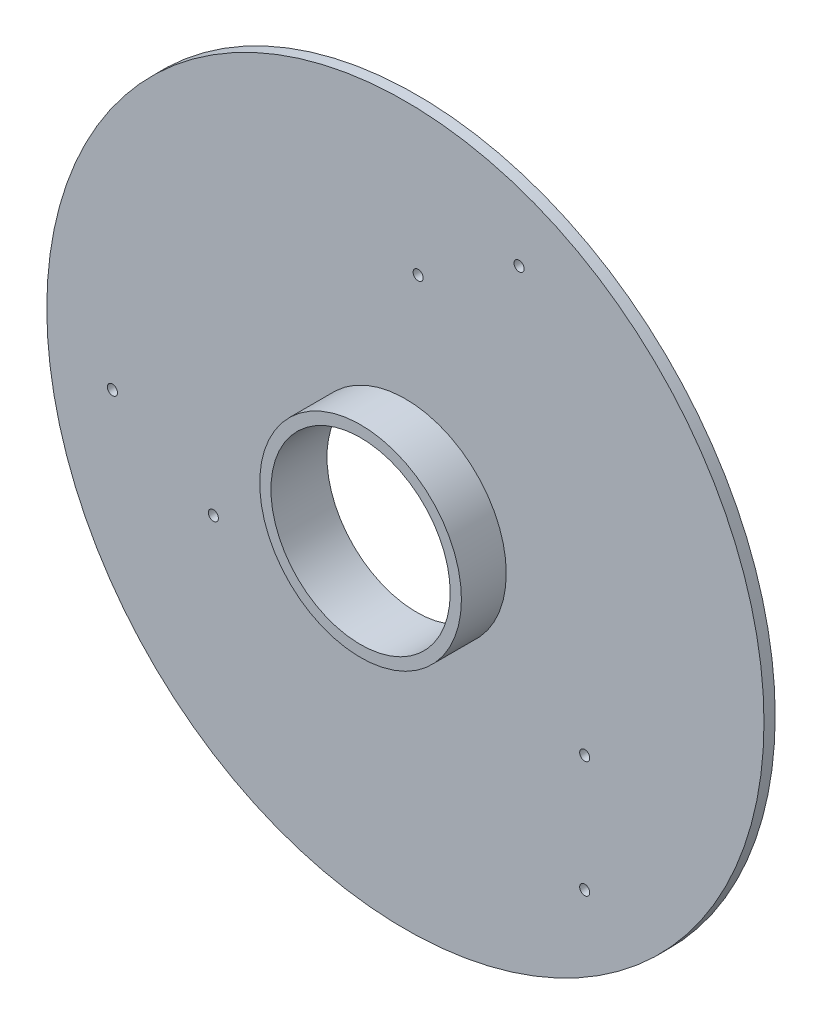
ISO-10303-21;
HEADER;
FILE_DESCRIPTION(('STEP AP214'),'2;1');
FILE_NAME('part.step','',(''),(''),'','','');
FILE_SCHEMA(('AUTOMOTIVE_DESIGN { 1 0 10303 214 1 1 1 1 }'));
ENDSEC;
DATA;
#1=APPLICATION_CONTEXT('core data for automotive mechanical design processes');
#2=APPLICATION_PROTOCOL_DEFINITION('international standard','automotive_design',2000,#1);
#3=PRODUCT_CONTEXT('',#1,'mechanical');
#4=PRODUCT('Part','Part','',(#3));
#5=PRODUCT_RELATED_PRODUCT_CATEGORY('part','',(#4));
#6=PRODUCT_DEFINITION_FORMATION('','',#4);
#7=PRODUCT_DEFINITION_CONTEXT('part definition',#1,'design');
#8=PRODUCT_DEFINITION('design','',#6,#7);
#9=PRODUCT_DEFINITION_SHAPE('','',#8);
#10=(LENGTH_UNIT() NAMED_UNIT(*) SI_UNIT(.MILLI.,.METRE.));
#11=(NAMED_UNIT(*) PLANE_ANGLE_UNIT() SI_UNIT($,.RADIAN.));
#12=(NAMED_UNIT(*) SI_UNIT($,.STERADIAN.) SOLID_ANGLE_UNIT());
#13=UNCERTAINTY_MEASURE_WITH_UNIT(LENGTH_MEASURE(1.E-05),#10,'distance_accuracy_value','');
#14=(GEOMETRIC_REPRESENTATION_CONTEXT(3) GLOBAL_UNCERTAINTY_ASSIGNED_CONTEXT((#13)) GLOBAL_UNIT_ASSIGNED_CONTEXT((#10,
#11,#12)) REPRESENTATION_CONTEXT('',''));
#15=CARTESIAN_POINT('',(0.,0.,0.));
#16=DIRECTION('',(0.,0.,1.));
#17=DIRECTION('',(1.,0.,0.));
#18=AXIS2_PLACEMENT_3D('',#15,#16,#17);
#19=CARTESIAN_POINT('',(0.,0.,50.));
#20=DIRECTION('',(0.,0.,1.));
#21=DIRECTION('',(1.,0.,0.));
#22=AXIS2_PLACEMENT_3D('',#19,#20,#21);
#23=PLANE('',#22);
#24=CARTESIAN_POINT('',(0.,0.,50.));
#25=DIRECTION('',(0.,0.,1.));
#26=DIRECTION('',(1.,0.,0.));
#27=AXIS2_PLACEMENT_3D('',#24,#25,#26);
#28=CIRCLE('',#27,450.);
#29=CARTESIAN_POINT('',(450.,0.,50.));
#30=VERTEX_POINT('',#29);
#31=EDGE_CURVE('E86',#30,#30,#28,.T.);
#32=ORIENTED_EDGE('',*,*,#31,.F.);
#33=EDGE_LOOP('',(#32));
#34=FACE_BOUND('',#33,.T.);
#35=CARTESIAN_POINT('',(507.16161046421,1216.57032302755,50.));
#36=DIRECTION('',(0.,0.,1.));
#37=DIRECTION('',(1.,0.,0.));
#38=AXIS2_PLACEMENT_3D('',#35,#36,#37);
#39=CIRCLE('',#38,22.5);
#40=CARTESIAN_POINT('',(529.66161046421,1216.57032302755,50.));
#41=VERTEX_POINT('',#40);
#42=EDGE_CURVE('E68',#41,#41,#39,.T.);
#43=ORIENTED_EDGE('',*,*,#42,.F.);
#44=EDGE_LOOP('',(#43));
#45=FACE_BOUND('',#44,.T.);
#46=CARTESIAN_POINT('',(-1307.1616104642,-169.070323027545,50.));
#47=DIRECTION('',(0.,0.,1.));
#48=DIRECTION('',(1.,0.,0.));
#49=AXIS2_PLACEMENT_3D('',#46,#47,#48);
#50=CIRCLE('',#49,22.4999999999999);
#51=CARTESIAN_POINT('',(-1284.6616104642,-169.070323027545,50.));
#52=VERTEX_POINT('',#51);
#53=EDGE_CURVE('E56',#52,#52,#50,.T.);
#54=ORIENTED_EDGE('',*,*,#53,.F.);
#55=EDGE_LOOP('',(#54));
#56=FACE_BOUND('',#55,.T.);
#57=CARTESIAN_POINT('',(800.,-1047.5,50.));
#58=DIRECTION('',(0.,0.,1.));
#59=DIRECTION('',(1.,0.,0.));
#60=AXIS2_PLACEMENT_3D('',#57,#58,#59);
#61=CIRCLE('',#60,22.5);
#62=CARTESIAN_POINT('',(822.5,-1047.5,50.));
#63=VERTEX_POINT('',#62);
#64=EDGE_CURVE('E45',#63,#63,#61,.T.);
#65=ORIENTED_EDGE('',*,*,#64,.F.);
#66=EDGE_LOOP('',(#65));
#67=FACE_BOUND('',#66,.T.);
#68=CARTESIAN_POINT('',(0.,0.,50.));
#69=DIRECTION('',(0.,0.,1.));
#70=DIRECTION('',(1.,0.,0.));
#71=AXIS2_PLACEMENT_3D('',#68,#69,#70);
#72=CIRCLE('',#71,1600.);
#73=CARTESIAN_POINT('',(1600.,0.,50.));
#74=VERTEX_POINT('',#73);
#75=EDGE_CURVE('E10',#74,#74,#72,.T.);
#76=ORIENTED_EDGE('',*,*,#75,.T.);
#77=EDGE_LOOP('',(#76));
#78=FACE_BOUND('',#77,.T.);
#79=CARTESIAN_POINT('',(800.,-527.5,50.));
#80=DIRECTION('',(0.,0.,1.));
#81=DIRECTION('',(1.,0.,0.));
#82=AXIS2_PLACEMENT_3D('',#79,#80,#81);
#83=CIRCLE('',#82,22.5);
#84=CARTESIAN_POINT('',(822.5,-527.5,50.));
#85=VERTEX_POINT('',#84);
#86=EDGE_CURVE('E50',#85,#85,#83,.T.);
#87=ORIENTED_EDGE('',*,*,#86,.F.);
#88=EDGE_LOOP('',(#87));
#89=FACE_BOUND('',#88,.T.);
#90=CARTESIAN_POINT('',(-856.828400496293,-429.070323027547,50.));
#91=DIRECTION('',(0.,0.,1.));
#92=DIRECTION('',(1.,0.,0.));
#93=AXIS2_PLACEMENT_3D('',#90,#91,#92);
#94=CIRCLE('',#93,22.5);
#95=CARTESIAN_POINT('',(-834.328400496293,-429.070323027547,50.));
#96=VERTEX_POINT('',#95);
#97=EDGE_CURVE('E62',#96,#96,#94,.T.);
#98=ORIENTED_EDGE('',*,*,#97,.F.);
#99=EDGE_LOOP('',(#98));
#100=FACE_BOUND('',#99,.T.);
#101=CARTESIAN_POINT('',(56.8284004963002,956.57032302755,50.));
#102=DIRECTION('',(0.,0.,1.));
#103=DIRECTION('',(1.,0.,0.));
#104=AXIS2_PLACEMENT_3D('',#101,#102,#103);
#105=CIRCLE('',#104,22.4999999999999);
#106=CARTESIAN_POINT('',(79.3284004963001,956.57032302755,50.));
#107=VERTEX_POINT('',#106);
#108=EDGE_CURVE('E74',#107,#107,#105,.T.);
#109=ORIENTED_EDGE('',*,*,#108,.F.);
#110=EDGE_LOOP('',(#109));
#111=FACE_BOUND('',#110,.T.);
#112=ADVANCED_FACE('F34',(#34,#45,#56,#67,#78,#89,#100,#111),#23,.T.);
#113=CARTESIAN_POINT('',(0.,0.,0.));
#114=DIRECTION('',(0.,0.,1.));
#115=DIRECTION('',(1.,0.,0.));
#116=AXIS2_PLACEMENT_3D('',#113,#114,#115);
#117=PLANE('',#116);
#118=CARTESIAN_POINT('',(0.,0.,0.));
#119=DIRECTION('',(0.,0.,1.));
#120=DIRECTION('',(1.,0.,0.));
#121=AXIS2_PLACEMENT_3D('',#118,#119,#120);
#122=CIRCLE('',#121,400.);
#123=CARTESIAN_POINT('',(400.,0.,0.));
#124=VERTEX_POINT('',#123);
#125=EDGE_CURVE('E80',#124,#124,#122,.T.);
#126=ORIENTED_EDGE('',*,*,#125,.T.);
#127=EDGE_LOOP('',(#126));
#128=FACE_BOUND('',#127,.T.);
#129=CARTESIAN_POINT('',(0.,0.,0.));
#130=DIRECTION('',(0.,0.,1.));
#131=DIRECTION('',(1.,0.,0.));
#132=AXIS2_PLACEMENT_3D('',#129,#130,#131);
#133=CIRCLE('',#132,1600.);
#134=CARTESIAN_POINT('',(1600.,0.,0.));
#135=VERTEX_POINT('',#134);
#136=EDGE_CURVE('E38',#135,#135,#133,.T.);
#137=ORIENTED_EDGE('',*,*,#136,.F.);
#138=EDGE_LOOP('',(#137));
#139=FACE_BOUND('',#138,.T.);
#140=CARTESIAN_POINT('',(800.,-1047.5,0.));
#141=DIRECTION('',(0.,0.,1.));
#142=DIRECTION('',(1.,0.,0.));
#143=AXIS2_PLACEMENT_3D('',#140,#141,#142);
#144=CIRCLE('',#143,22.5);
#145=CARTESIAN_POINT('',(822.5,-1047.5,0.));
#146=VERTEX_POINT('',#145);
#147=EDGE_CURVE('E47',#146,#146,#144,.T.);
#148=ORIENTED_EDGE('',*,*,#147,.T.);
#149=EDGE_LOOP('',(#148));
#150=FACE_BOUND('',#149,.T.);
#151=CARTESIAN_POINT('',(800.,-527.5,0.));
#152=DIRECTION('',(0.,0.,1.));
#153=DIRECTION('',(1.,0.,0.));
#154=AXIS2_PLACEMENT_3D('',#151,#152,#153);
#155=CIRCLE('',#154,22.5);
#156=CARTESIAN_POINT('',(822.5,-527.5,0.));
#157=VERTEX_POINT('',#156);
#158=EDGE_CURVE('E53',#157,#157,#155,.T.);
#159=ORIENTED_EDGE('',*,*,#158,.T.);
#160=EDGE_LOOP('',(#159));
#161=FACE_BOUND('',#160,.T.);
#162=CARTESIAN_POINT('',(-1307.1616104642,-169.070323027545,0.));
#163=DIRECTION('',(0.,0.,1.));
#164=DIRECTION('',(1.,0.,0.));
#165=AXIS2_PLACEMENT_3D('',#162,#163,#164);
#166=CIRCLE('',#165,22.4999999999999);
#167=CARTESIAN_POINT('',(-1284.6616104642,-169.070323027545,0.));
#168=VERTEX_POINT('',#167);
#169=EDGE_CURVE('E59',#168,#168,#166,.T.);
#170=ORIENTED_EDGE('',*,*,#169,.T.);
#171=EDGE_LOOP('',(#170));
#172=FACE_BOUND('',#171,.T.);
#173=CARTESIAN_POINT('',(-856.828400496293,-429.070323027547,0.));
#174=DIRECTION('',(0.,0.,1.));
#175=DIRECTION('',(1.,0.,0.));
#176=AXIS2_PLACEMENT_3D('',#173,#174,#175);
#177=CIRCLE('',#176,22.5);
#178=CARTESIAN_POINT('',(-834.328400496293,-429.070323027547,0.));
#179=VERTEX_POINT('',#178);
#180=EDGE_CURVE('E65',#179,#179,#177,.T.);
#181=ORIENTED_EDGE('',*,*,#180,.T.);
#182=EDGE_LOOP('',(#181));
#183=FACE_BOUND('',#182,.T.);
#184=CARTESIAN_POINT('',(507.16161046421,1216.57032302755,0.));
#185=DIRECTION('',(0.,0.,1.));
#186=DIRECTION('',(1.,0.,0.));
#187=AXIS2_PLACEMENT_3D('',#184,#185,#186);
#188=CIRCLE('',#187,22.5);
#189=CARTESIAN_POINT('',(529.66161046421,1216.57032302755,0.));
#190=VERTEX_POINT('',#189);
#191=EDGE_CURVE('E71',#190,#190,#188,.T.);
#192=ORIENTED_EDGE('',*,*,#191,.T.);
#193=EDGE_LOOP('',(#192));
#194=FACE_BOUND('',#193,.T.);
#195=CARTESIAN_POINT('',(56.8284004963002,956.57032302755,0.));
#196=DIRECTION('',(0.,0.,1.));
#197=DIRECTION('',(1.,0.,0.));
#198=AXIS2_PLACEMENT_3D('',#195,#196,#197);
#199=CIRCLE('',#198,22.4999999999999);
#200=CARTESIAN_POINT('',(79.3284004963001,956.57032302755,0.));
#201=VERTEX_POINT('',#200);
#202=EDGE_CURVE('E77',#201,#201,#199,.T.);
#203=ORIENTED_EDGE('',*,*,#202,.T.);
#204=EDGE_LOOP('',(#203));
#205=FACE_BOUND('',#204,.T.);
#206=ADVANCED_FACE('F111',(#128,#139,#150,#161,#172,#183,#194,#205),#117,.F.);
#207=CARTESIAN_POINT('',(0.,0.,50.));
#208=DIRECTION('',(0.,0.,-1.));
#209=DIRECTION('',(-1.,0.,0.));
#210=AXIS2_PLACEMENT_3D('',#207,#208,#209);
#211=CYLINDRICAL_SURFACE('',#210,1600.);
#212=ORIENTED_EDGE('',*,*,#75,.F.);
#213=EDGE_LOOP('',(#212));
#214=FACE_BOUND('',#213,.T.);
#215=ORIENTED_EDGE('',*,*,#136,.T.);
#216=EDGE_LOOP('',(#215));
#217=FACE_BOUND('',#216,.T.);
#218=ADVANCED_FACE('F36',(#214,#217),#211,.T.);
#219=CARTESIAN_POINT('',(800.,-1047.5,50.));
#220=DIRECTION('',(0.,0.,-1.));
#221=DIRECTION('',(-1.,0.,0.));
#222=AXIS2_PLACEMENT_3D('',#219,#220,#221);
#223=CYLINDRICAL_SURFACE('',#222,22.5);
#224=ORIENTED_EDGE('',*,*,#64,.T.);
#225=EDGE_LOOP('',(#224));
#226=FACE_BOUND('',#225,.T.);
#227=ORIENTED_EDGE('',*,*,#147,.F.);
#228=EDGE_LOOP('',(#227));
#229=FACE_BOUND('',#228,.T.);
#230=ADVANCED_FACE('F137',(#226,#229),#223,.F.);
#231=CARTESIAN_POINT('',(800.,-527.5,50.));
#232=DIRECTION('',(0.,0.,-1.));
#233=DIRECTION('',(-1.,0.,0.));
#234=AXIS2_PLACEMENT_3D('',#231,#232,#233);
#235=CYLINDRICAL_SURFACE('',#234,22.5);
#236=ORIENTED_EDGE('',*,*,#86,.T.);
#237=EDGE_LOOP('',(#236));
#238=FACE_BOUND('',#237,.T.);
#239=ORIENTED_EDGE('',*,*,#158,.F.);
#240=EDGE_LOOP('',(#239));
#241=FACE_BOUND('',#240,.T.);
#242=ADVANCED_FACE('F143',(#238,#241),#235,.F.);
#243=CARTESIAN_POINT('',(-1307.1616104642,-169.070323027545,50.));
#244=DIRECTION('',(0.,0.,-1.));
#245=DIRECTION('',(-1.,0.,0.));
#246=AXIS2_PLACEMENT_3D('',#243,#244,#245);
#247=CYLINDRICAL_SURFACE('',#246,22.4999999999999);
#248=ORIENTED_EDGE('',*,*,#53,.T.);
#249=EDGE_LOOP('',(#248));
#250=FACE_BOUND('',#249,.T.);
#251=ORIENTED_EDGE('',*,*,#169,.F.);
#252=EDGE_LOOP('',(#251));
#253=FACE_BOUND('',#252,.T.);
#254=ADVANCED_FACE('F147',(#250,#253),#247,.F.);
#255=CARTESIAN_POINT('',(-856.828400496293,-429.070323027547,50.));
#256=DIRECTION('',(0.,0.,-1.));
#257=DIRECTION('',(-1.,0.,0.));
#258=AXIS2_PLACEMENT_3D('',#255,#256,#257);
#259=CYLINDRICAL_SURFACE('',#258,22.5);
#260=ORIENTED_EDGE('',*,*,#97,.T.);
#261=EDGE_LOOP('',(#260));
#262=FACE_BOUND('',#261,.T.);
#263=ORIENTED_EDGE('',*,*,#180,.F.);
#264=EDGE_LOOP('',(#263));
#265=FACE_BOUND('',#264,.T.);
#266=ADVANCED_FACE('F151',(#262,#265),#259,.F.);
#267=CARTESIAN_POINT('',(507.16161046421,1216.57032302755,50.));
#268=DIRECTION('',(0.,0.,-1.));
#269=DIRECTION('',(-1.,0.,0.));
#270=AXIS2_PLACEMENT_3D('',#267,#268,#269);
#271=CYLINDRICAL_SURFACE('',#270,22.5);
#272=ORIENTED_EDGE('',*,*,#42,.T.);
#273=EDGE_LOOP('',(#272));
#274=FACE_BOUND('',#273,.T.);
#275=ORIENTED_EDGE('',*,*,#191,.F.);
#276=EDGE_LOOP('',(#275));
#277=FACE_BOUND('',#276,.T.);
#278=ADVANCED_FACE('F128',(#274,#277),#271,.F.);
#279=CARTESIAN_POINT('',(56.8284004963002,956.57032302755,50.));
#280=DIRECTION('',(0.,0.,-1.));
#281=DIRECTION('',(-1.,0.,0.));
#282=AXIS2_PLACEMENT_3D('',#279,#280,#281);
#283=CYLINDRICAL_SURFACE('',#282,22.4999999999999);
#284=ORIENTED_EDGE('',*,*,#108,.T.);
#285=EDGE_LOOP('',(#284));
#286=FACE_BOUND('',#285,.T.);
#287=ORIENTED_EDGE('',*,*,#202,.F.);
#288=EDGE_LOOP('',(#287));
#289=FACE_BOUND('',#288,.T.);
#290=ADVANCED_FACE('F125',(#286,#289),#283,.F.);
#291=CARTESIAN_POINT('',(0.,0.,0.));
#292=DIRECTION('',(0.,0.,1.));
#293=DIRECTION('',(1.,0.,0.));
#294=AXIS2_PLACEMENT_3D('',#291,#292,#293);
#295=CYLINDRICAL_SURFACE('',#294,400.);
#296=ORIENTED_EDGE('',*,*,#125,.F.);
#297=EDGE_LOOP('',(#296));
#298=FACE_BOUND('',#297,.T.);
#299=CARTESIAN_POINT('',(0.,0.,250.));
#300=DIRECTION('',(0.,0.,1.));
#301=DIRECTION('',(1.,0.,0.));
#302=AXIS2_PLACEMENT_3D('',#299,#300,#301);
#303=CIRCLE('',#302,400.);
#304=CARTESIAN_POINT('',(400.,0.,250.));
#305=VERTEX_POINT('',#304);
#306=EDGE_CURVE('E89',#305,#305,#303,.T.);
#307=ORIENTED_EDGE('',*,*,#306,.T.);
#308=EDGE_LOOP('',(#307));
#309=FACE_BOUND('',#308,.T.);
#310=ADVANCED_FACE('F95',(#298,#309),#295,.F.);
#311=CARTESIAN_POINT('',(0.,0.,250.));
#312=DIRECTION('',(0.,0.,-1.));
#313=DIRECTION('',(-1.,0.,0.));
#314=AXIS2_PLACEMENT_3D('',#311,#312,#313);
#315=CYLINDRICAL_SURFACE('',#314,450.);
#316=CARTESIAN_POINT('',(0.,0.,250.));
#317=DIRECTION('',(0.,0.,1.));
#318=DIRECTION('',(1.,0.,0.));
#319=AXIS2_PLACEMENT_3D('',#316,#317,#318);
#320=CIRCLE('',#319,450.);
#321=CARTESIAN_POINT('',(450.,0.,250.));
#322=VERTEX_POINT('',#321);
#323=EDGE_CURVE('E85',#322,#322,#320,.T.);
#324=ORIENTED_EDGE('',*,*,#323,.F.);
#325=EDGE_LOOP('',(#324));
#326=FACE_BOUND('',#325,.T.);
#327=ORIENTED_EDGE('',*,*,#31,.T.);
#328=EDGE_LOOP('',(#327));
#329=FACE_BOUND('',#328,.T.);
#330=ADVANCED_FACE('F100',(#326,#329),#315,.T.);
#331=CARTESIAN_POINT('',(0.,0.,250.));
#332=DIRECTION('',(0.,0.,1.));
#333=DIRECTION('',(1.,0.,0.));
#334=AXIS2_PLACEMENT_3D('',#331,#332,#333);
#335=PLANE('',#334);
#336=ORIENTED_EDGE('',*,*,#306,.F.);
#337=EDGE_LOOP('',(#336));
#338=FACE_BOUND('',#337,.T.);
#339=ORIENTED_EDGE('',*,*,#323,.T.);
#340=EDGE_LOOP('',(#339));
#341=FACE_BOUND('',#340,.T.);
#342=ADVANCED_FACE('F97',(#338,#341),#335,.T.);
#343=CLOSED_SHELL('',(#112,#206,#218,#230,#242,#254,#266,#278,#290,#310,#330,#342));
#344=MANIFOLD_SOLID_BREP('B2',#343);
#345=ADVANCED_BREP_SHAPE_REPRESENTATION('',(#18,#344),#14);
#346=SHAPE_DEFINITION_REPRESENTATION(#9,#345);
ENDSEC;
END-ISO-10303-21;
